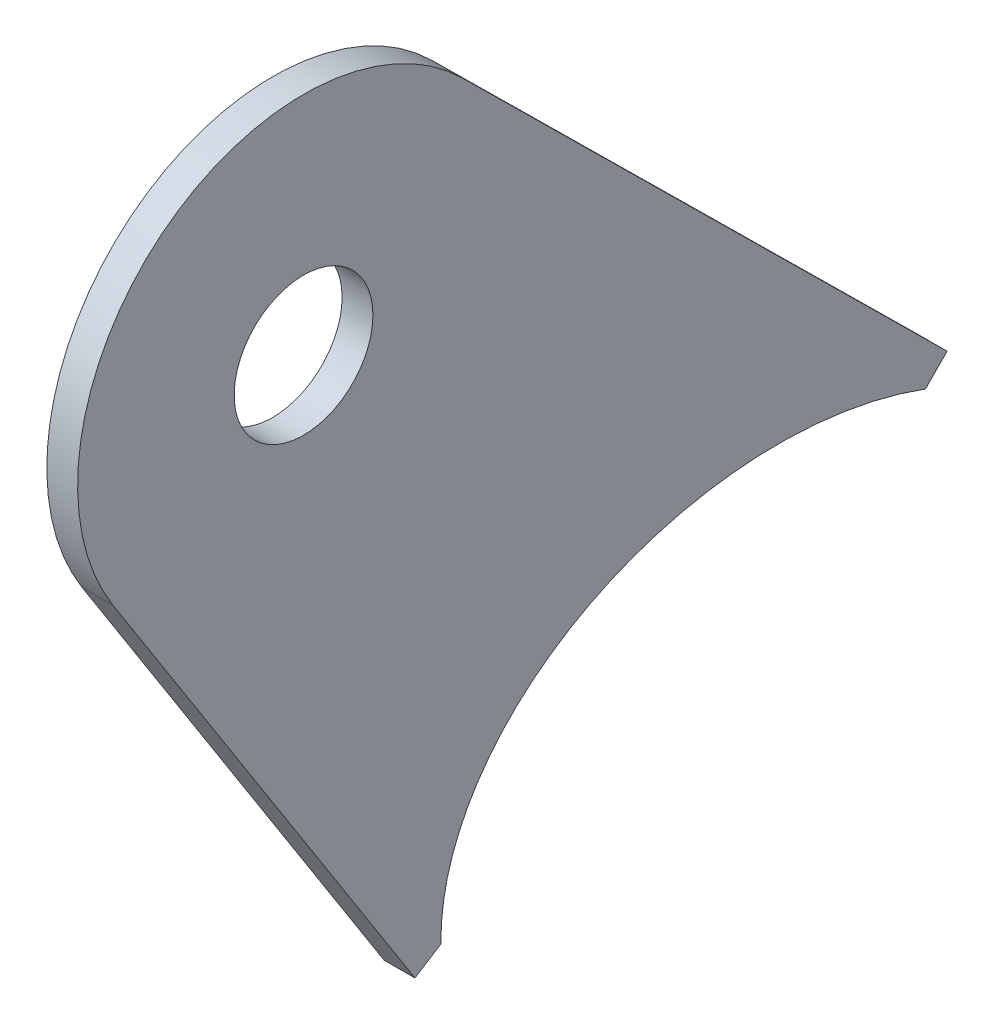
ISO-10303-21;
HEADER;
FILE_DESCRIPTION(('STEP AP214'),'2;1');
FILE_NAME('part.step','',(''),(''),'','','');
FILE_SCHEMA(('AUTOMOTIVE_DESIGN { 1 0 10303 214 1 1 1 1 }'));
ENDSEC;
DATA;
#1=APPLICATION_CONTEXT('core data for automotive mechanical design processes');
#2=APPLICATION_PROTOCOL_DEFINITION('international standard','automotive_design',2000,#1);
#3=PRODUCT_CONTEXT('',#1,'mechanical');
#4=PRODUCT('Part','Part','',(#3));
#5=PRODUCT_RELATED_PRODUCT_CATEGORY('part','',(#4));
#6=PRODUCT_DEFINITION_FORMATION('','',#4);
#7=PRODUCT_DEFINITION_CONTEXT('part definition',#1,'design');
#8=PRODUCT_DEFINITION('design','',#6,#7);
#9=PRODUCT_DEFINITION_SHAPE('','',#8);
#10=(LENGTH_UNIT() NAMED_UNIT(*) SI_UNIT(.MILLI.,.METRE.));
#11=(NAMED_UNIT(*) PLANE_ANGLE_UNIT() SI_UNIT($,.RADIAN.));
#12=(NAMED_UNIT(*) SI_UNIT($,.STERADIAN.) SOLID_ANGLE_UNIT());
#13=UNCERTAINTY_MEASURE_WITH_UNIT(LENGTH_MEASURE(1.E-05),#10,'distance_accuracy_value','');
#14=(GEOMETRIC_REPRESENTATION_CONTEXT(3) GLOBAL_UNCERTAINTY_ASSIGNED_CONTEXT((#13)) GLOBAL_UNIT_ASSIGNED_CONTEXT((#10,
#11,#12)) REPRESENTATION_CONTEXT('',''));
#15=CARTESIAN_POINT('',(0.,0.,0.));
#16=DIRECTION('',(0.,0.,1.));
#17=DIRECTION('',(1.,0.,0.));
#18=AXIS2_PLACEMENT_3D('',#15,#16,#17);
#19=CARTESIAN_POINT('',(-157.5,-2.,-57.1231051206223));
#20=DIRECTION('',(1.,0.,0.));
#21=DIRECTION('',(0.,0.,-1.));
#22=AXIS2_PLACEMENT_3D('',#19,#20,#21);
#23=ELLIPSE('',#22,16.4341542368134,12.7);
#24=DIRECTION('',(-1.,0.,0.));
#25=VECTOR('',#24,1.);
#26=SURFACE_OF_LINEAR_EXTRUSION('',#23,#25);
#27=CARTESIAN_POINT('',(-159.,-2.,-57.1231051206223));
#28=DIRECTION('',(1.,0.,0.));
#29=DIRECTION('',(0.,0.,-1.));
#30=AXIS2_PLACEMENT_3D('',#27,#28,#29);
#31=ELLIPSE('',#30,16.4341542368134,12.7);
#32=CARTESIAN_POINT('',(-159.,9.43104454813601,-64.2837953448498));
#33=VERTEX_POINT('',#32);
#34=CARTESIAN_POINT('',(-159.,-2.16992660847582,-40.6904220174906));
#35=VERTEX_POINT('',#34);
#36=EDGE_CURVE('E121',#33,#35,#31,.T.);
#37=ORIENTED_EDGE('',*,*,#36,.F.);
#38=DIRECTION('',(-1.,0.,0.));
#39=VECTOR('',#38,1.);
#40=CARTESIAN_POINT('',(-157.5,9.43104454813601,-64.2837953448498));
#41=LINE('',#40,#39);
#42=CARTESIAN_POINT('',(-157.5,9.43104454813601,-64.2837953448498));
#43=VERTEX_POINT('',#42);
#44=EDGE_CURVE('E11',#43,#33,#41,.T.);
#45=ORIENTED_EDGE('',*,*,#44,.F.);
#46=CARTESIAN_POINT('',(-157.5,-2.16992660847582,-40.6904220174906));
#47=VERTEX_POINT('',#46);
#48=EDGE_CURVE('E137',#43,#47,#23,.T.);
#49=ORIENTED_EDGE('',*,*,#48,.T.);
#50=DIRECTION('',(-1.,0.,0.));
#51=VECTOR('',#50,1.);
#52=CARTESIAN_POINT('',(-157.5,-2.16992660847582,-40.6904220174906));
#53=LINE('',#52,#51);
#54=EDGE_CURVE('E82',#47,#35,#53,.T.);
#55=ORIENTED_EDGE('',*,*,#54,.T.);
#56=EDGE_LOOP('',(#37,#45,#49,#55));
#57=FACE_BOUND('',#56,.T.);
#58=ADVANCED_FACE('F36',(#57),#26,.T.);
#59=CARTESIAN_POINT('',(-157.5,-27.4803599676832,-27.8102810022709));
#60=DIRECTION('',(0.,-0.702874939273961,-0.711313446899906));
#61=DIRECTION('',(0.,0.711313446899906,-0.702874939273961));
#62=AXIS2_PLACEMENT_3D('',#59,#60,#61);
#63=PLANE('',#62);
#64=DIRECTION('',(0.,-0.711313446899906,0.702874939273961));
#65=VECTOR('',#64,1.);
#66=CARTESIAN_POINT('',(-159.,-27.4803599676832,-27.8102810022709));
#67=LINE('',#66,#65);
#68=CARTESIAN_POINT('',(-159.,10.4980147184859,-65.3381077537608));
#69=VERTEX_POINT('',#68);
#70=EDGE_CURVE('E124',#69,#33,#67,.T.);
#71=ORIENTED_EDGE('',*,*,#70,.F.);
#72=DIRECTION('',(-1.,0.,0.));
#73=VECTOR('',#72,1.);
#74=CARTESIAN_POINT('',(-157.5,10.4980147184859,-65.3381077537608));
#75=LINE('',#74,#73);
#76=CARTESIAN_POINT('',(-157.5,10.4980147184859,-65.3381077537608));
#77=VERTEX_POINT('',#76);
#78=EDGE_CURVE('E45',#77,#69,#75,.T.);
#79=ORIENTED_EDGE('',*,*,#78,.F.);
#80=DIRECTION('',(0.,-0.711313446899906,0.702874939273961));
#81=VECTOR('',#80,1.);
#82=CARTESIAN_POINT('',(-157.5,-27.4803599676832,-27.8102810022709));
#83=LINE('',#82,#81);
#84=EDGE_CURVE('E153',#77,#43,#83,.T.);
#85=ORIENTED_EDGE('',*,*,#84,.T.);
#86=ORIENTED_EDGE('',*,*,#44,.T.);
#87=EDGE_LOOP('',(#71,#79,#85,#86));
#88=FACE_BOUND('',#87,.T.);
#89=ADVANCED_FACE('F146',(#88),#63,.T.);
#90=CARTESIAN_POINT('',(-157.5,37.978374686169,-37.5278267514899));
#91=DIRECTION('',(0.,0.711313446899906,-0.702874939273961));
#92=DIRECTION('',(0.,0.702874939273961,0.711313446899906));
#93=AXIS2_PLACEMENT_3D('',#90,#91,#92);
#94=PLANE('',#93);
#95=DIRECTION('',(0.,-0.702874939273961,-0.711313446899906));
#96=VECTOR('',#95,1.);
#97=CARTESIAN_POINT('',(-159.,37.978374686169,-37.5278267514899));
#98=LINE('',#97,#96);
#99=CARTESIAN_POINT('',(-159.,33.824447915899,-41.7316243320136));
#100=VERTEX_POINT('',#99);
#101=EDGE_CURVE('E127',#100,#69,#98,.T.);
#102=ORIENTED_EDGE('',*,*,#101,.F.);
#103=DIRECTION('',(-1.,0.,0.));
#104=VECTOR('',#103,1.);
#105=CARTESIAN_POINT('',(-157.5,33.824447915899,-41.7316243320136));
#106=LINE('',#105,#104);
#107=CARTESIAN_POINT('',(-157.5,33.824447915899,-41.7316243320136));
#108=VERTEX_POINT('',#107);
#109=EDGE_CURVE('E110',#108,#100,#106,.T.);
#110=ORIENTED_EDGE('',*,*,#109,.F.);
#111=DIRECTION('',(0.,-0.702874939273961,-0.711313446899906));
#112=VECTOR('',#111,1.);
#113=CARTESIAN_POINT('',(-157.5,37.978374686169,-37.5278267514899));
#114=LINE('',#113,#112);
#115=EDGE_CURVE('E103',#108,#77,#114,.T.);
#116=ORIENTED_EDGE('',*,*,#115,.T.);
#117=ORIENTED_EDGE('',*,*,#78,.T.);
#118=EDGE_LOOP('',(#102,#110,#116,#117));
#119=FACE_BOUND('',#118,.T.);
#120=ADVANCED_FACE('F143',(#119),#94,.T.);
#121=CARTESIAN_POINT('',(-157.5,26.,-34.));
#122=DIRECTION('',(-1.,0.,0.));
#123=DIRECTION('',(0.,0.,1.));
#124=AXIS2_PLACEMENT_3D('',#121,#122,#123);
#125=CYLINDRICAL_SURFACE('',#124,11.);
#126=CARTESIAN_POINT('',(-159.,26.,-34.));
#127=DIRECTION('',(1.,0.,0.));
#128=DIRECTION('',(0.,0.,-1.));
#129=AXIS2_PLACEMENT_3D('',#126,#127,#128);
#130=CIRCLE('',#129,11.);
#131=CARTESIAN_POINT('',(-159.,20.0873457571109,-24.7241970803576));
#132=VERTEX_POINT('',#131);
#133=EDGE_CURVE('E109',#100,#132,#130,.T.);
#134=ORIENTED_EDGE('',*,*,#133,.T.);
#135=DIRECTION('',(-1.,0.,0.));
#136=VECTOR('',#135,1.);
#137=CARTESIAN_POINT('',(-157.5,20.0873457571109,-24.7241970803576));
#138=LINE('',#137,#136);
#139=CARTESIAN_POINT('',(-157.5,20.0873457571109,-24.7241970803576));
#140=VERTEX_POINT('',#139);
#141=EDGE_CURVE('E106',#140,#132,#138,.T.);
#142=ORIENTED_EDGE('',*,*,#141,.F.);
#143=CARTESIAN_POINT('',(-157.5,26.,-34.));
#144=DIRECTION('',(1.,0.,0.));
#145=DIRECTION('',(0.,0.,-1.));
#146=AXIS2_PLACEMENT_3D('',#143,#144,#145);
#147=CIRCLE('',#146,11.);
#148=EDGE_CURVE('E95',#108,#140,#147,.T.);
#149=ORIENTED_EDGE('',*,*,#148,.F.);
#150=ORIENTED_EDGE('',*,*,#109,.T.);
#151=EDGE_LOOP('',(#134,#142,#149,#150));
#152=FACE_BOUND('',#151,.T.);
#153=ADVANCED_FACE('F107',(#152),#125,.T.);
#154=CARTESIAN_POINT('',(-157.5,17.0101838705135,-26.6856654774835));
#155=DIRECTION('',(0.,0.537514022080828,-0.843254810876577));
#156=DIRECTION('',(0.,0.843254810876577,0.537514022080828));
#157=AXIS2_PLACEMENT_3D('',#154,#155,#156);
#158=PLANE('',#157);
#159=DIRECTION('',(0.,-0.843254810876577,-0.537514022080828));
#160=VECTOR('',#159,1.);
#161=CARTESIAN_POINT('',(-159.,17.0101838705135,-26.6856654774835));
#162=LINE('',#161,#160);
#163=CARTESIAN_POINT('',(-159.,-2.97619764159707,-39.4255398011758));
#164=VERTEX_POINT('',#163);
#165=EDGE_CURVE('E75',#132,#164,#162,.T.);
#166=ORIENTED_EDGE('',*,*,#165,.T.);
#167=DIRECTION('',(-1.,0.,0.));
#168=VECTOR('',#167,1.);
#169=CARTESIAN_POINT('',(-157.5,-2.97619764159707,-39.4255398011758));
#170=LINE('',#169,#168);
#171=CARTESIAN_POINT('',(-157.5,-2.97619764159707,-39.4255398011758));
#172=VERTEX_POINT('',#171);
#173=EDGE_CURVE('E111',#172,#164,#170,.T.);
#174=ORIENTED_EDGE('',*,*,#173,.F.);
#175=DIRECTION('',(0.,-0.843254810876577,-0.537514022080828));
#176=VECTOR('',#175,1.);
#177=CARTESIAN_POINT('',(-157.5,17.0101838705135,-26.6856654774835));
#178=LINE('',#177,#176);
#179=EDGE_CURVE('E100',#140,#172,#178,.T.);
#180=ORIENTED_EDGE('',*,*,#179,.F.);
#181=ORIENTED_EDGE('',*,*,#141,.T.);
#182=EDGE_LOOP('',(#166,#174,#180,#181));
#183=FACE_BOUND('',#182,.T.);
#184=ADVANCED_FACE('F113',(#183),#158,.F.);
#185=CARTESIAN_POINT('',(-157.5,-19.9863815121106,-12.7398743236923));
#186=DIRECTION('',(0.,0.843254810876576,0.537514022080829));
#187=DIRECTION('',(0.,-0.537514022080829,0.843254810876576));
#188=AXIS2_PLACEMENT_3D('',#185,#186,#187);
#189=PLANE('',#188);
#190=DIRECTION('',(0.,0.537514022080829,-0.843254810876576));
#191=VECTOR('',#190,1.);
#192=CARTESIAN_POINT('',(-159.,-19.9863815121106,-12.7398743236923));
#193=LINE('',#192,#191);
#194=EDGE_CURVE('E132',#164,#35,#193,.T.);
#195=ORIENTED_EDGE('',*,*,#194,.T.);
#196=ORIENTED_EDGE('',*,*,#54,.F.);
#197=DIRECTION('',(0.,0.537514022080829,-0.843254810876576));
#198=VECTOR('',#197,1.);
#199=CARTESIAN_POINT('',(-157.5,-19.9863815121106,-12.7398743236923));
#200=LINE('',#199,#198);
#201=EDGE_CURVE('E53',#172,#47,#200,.T.);
#202=ORIENTED_EDGE('',*,*,#201,.F.);
#203=ORIENTED_EDGE('',*,*,#173,.T.);
#204=EDGE_LOOP('',(#195,#196,#202,#203));
#205=FACE_BOUND('',#204,.T.);
#206=ADVANCED_FACE('F152',(#205),#189,.F.);
#207=CARTESIAN_POINT('',(-157.5,26.,-34.));
#208=DIRECTION('',(-1.,0.,0.));
#209=DIRECTION('',(0.,0.,1.));
#210=AXIS2_PLACEMENT_3D('',#207,#208,#209);
#211=CYLINDRICAL_SURFACE('',#210,3.37820000000001);
#212=CARTESIAN_POINT('',(-157.5,26.,-34.));
#213=DIRECTION('',(1.,0.,0.));
#214=DIRECTION('',(0.,0.,-1.));
#215=AXIS2_PLACEMENT_3D('',#212,#213,#214);
#216=CIRCLE('',#215,3.37820000000001);
#217=CARTESIAN_POINT('',(-157.5,26.,-37.3782));
#218=VERTEX_POINT('',#217);
#219=EDGE_CURVE('E115',#218,#218,#216,.T.);
#220=ORIENTED_EDGE('',*,*,#219,.T.);
#221=EDGE_LOOP('',(#220));
#222=FACE_BOUND('',#221,.T.);
#223=CARTESIAN_POINT('',(-159.,26.,-34.));
#224=DIRECTION('',(1.,0.,0.));
#225=DIRECTION('',(0.,0.,-1.));
#226=AXIS2_PLACEMENT_3D('',#223,#224,#225);
#227=CIRCLE('',#226,3.37820000000001);
#228=CARTESIAN_POINT('',(-159.,26.,-37.3782));
#229=VERTEX_POINT('',#228);
#230=EDGE_CURVE('E134',#229,#229,#227,.T.);
#231=ORIENTED_EDGE('',*,*,#230,.F.);
#232=EDGE_LOOP('',(#231));
#233=FACE_BOUND('',#232,.T.);
#234=ADVANCED_FACE('F171',(#222,#233),#211,.F.);
#235=CARTESIAN_POINT('',(-157.5,0.,0.));
#236=DIRECTION('',(1.,0.,0.));
#237=DIRECTION('',(0.,0.,-1.));
#238=AXIS2_PLACEMENT_3D('',#235,#236,#237);
#239=PLANE('',#238);
#240=ORIENTED_EDGE('',*,*,#48,.F.);
#241=ORIENTED_EDGE('',*,*,#84,.F.);
#242=ORIENTED_EDGE('',*,*,#115,.F.);
#243=ORIENTED_EDGE('',*,*,#148,.T.);
#244=ORIENTED_EDGE('',*,*,#179,.T.);
#245=ORIENTED_EDGE('',*,*,#201,.T.);
#246=EDGE_LOOP('',(#240,#241,#242,#243,#244,#245));
#247=FACE_BOUND('',#246,.T.);
#248=ORIENTED_EDGE('',*,*,#219,.F.);
#249=EDGE_LOOP('',(#248));
#250=FACE_BOUND('',#249,.T.);
#251=ADVANCED_FACE('F97',(#247,#250),#239,.T.);
#252=CARTESIAN_POINT('',(-159.,0.,0.));
#253=DIRECTION('',(1.,0.,0.));
#254=DIRECTION('',(0.,0.,-1.));
#255=AXIS2_PLACEMENT_3D('',#252,#253,#254);
#256=PLANE('',#255);
#257=ORIENTED_EDGE('',*,*,#36,.T.);
#258=ORIENTED_EDGE('',*,*,#194,.F.);
#259=ORIENTED_EDGE('',*,*,#165,.F.);
#260=ORIENTED_EDGE('',*,*,#133,.F.);
#261=ORIENTED_EDGE('',*,*,#101,.T.);
#262=ORIENTED_EDGE('',*,*,#70,.T.);
#263=EDGE_LOOP('',(#257,#258,#259,#260,#261,#262));
#264=FACE_BOUND('',#263,.T.);
#265=ORIENTED_EDGE('',*,*,#230,.T.);
#266=EDGE_LOOP('',(#265));
#267=FACE_BOUND('',#266,.T.);
#268=ADVANCED_FACE('F148',(#264,#267),#256,.F.);
#269=CLOSED_SHELL('',(#58,#89,#120,#153,#184,#206,#234,#251,#268));
#270=MANIFOLD_SOLID_BREP('B2',#269);
#271=ADVANCED_BREP_SHAPE_REPRESENTATION('',(#18,#270),#14);
#272=SHAPE_DEFINITION_REPRESENTATION(#9,#271);
ENDSEC;
END-ISO-10303-21;
